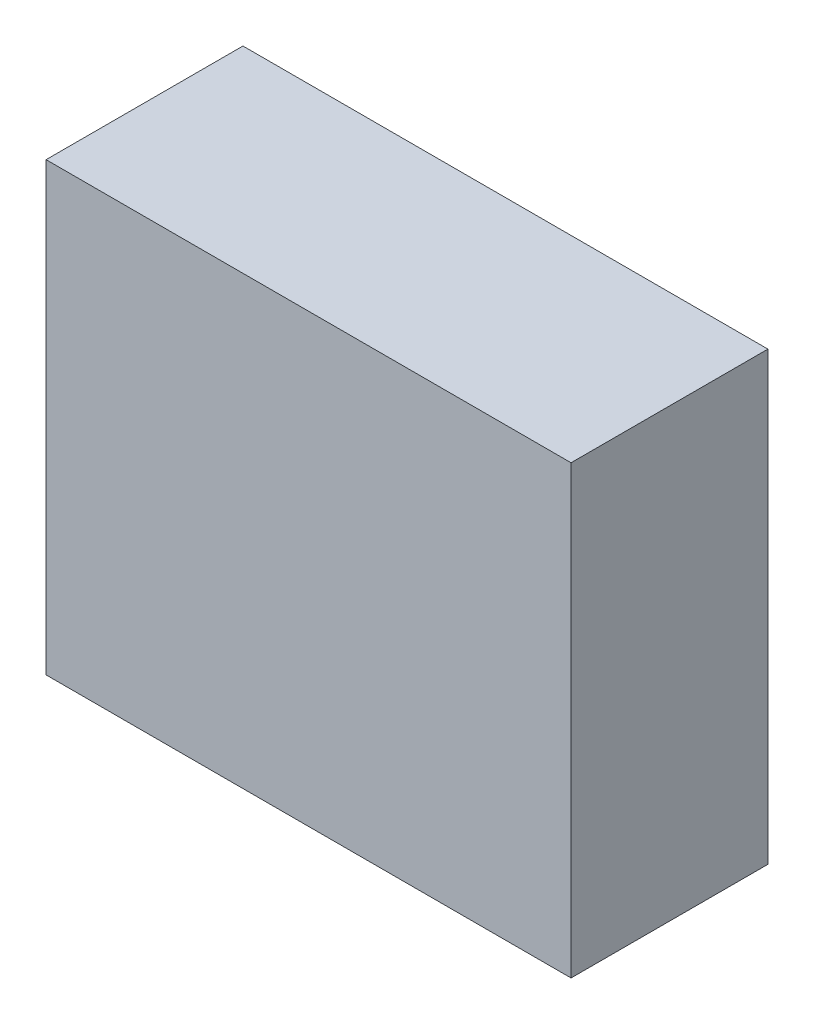
ISO-10303-21;
HEADER;
FILE_DESCRIPTION(('STEP AP214'),'2;1');
FILE_NAME('part.step','',(''),(''),'','','');
FILE_SCHEMA(('AUTOMOTIVE_DESIGN { 1 0 10303 214 1 1 1 1 }'));
ENDSEC;
DATA;
#1=APPLICATION_CONTEXT('core data for automotive mechanical design processes');
#2=APPLICATION_PROTOCOL_DEFINITION('international standard','automotive_design',2000,#1);
#3=PRODUCT_CONTEXT('',#1,'mechanical');
#4=PRODUCT('Part','Part','',(#3));
#5=PRODUCT_RELATED_PRODUCT_CATEGORY('part','',(#4));
#6=PRODUCT_DEFINITION_FORMATION('','',#4);
#7=PRODUCT_DEFINITION_CONTEXT('part definition',#1,'design');
#8=PRODUCT_DEFINITION('design','',#6,#7);
#9=PRODUCT_DEFINITION_SHAPE('','',#8);
#10=(LENGTH_UNIT() NAMED_UNIT(*) SI_UNIT(.MILLI.,.METRE.));
#11=(NAMED_UNIT(*) PLANE_ANGLE_UNIT() SI_UNIT($,.RADIAN.));
#12=(NAMED_UNIT(*) SI_UNIT($,.STERADIAN.) SOLID_ANGLE_UNIT());
#13=UNCERTAINTY_MEASURE_WITH_UNIT(LENGTH_MEASURE(1.E-05),#10,'distance_accuracy_value','');
#14=(GEOMETRIC_REPRESENTATION_CONTEXT(3) GLOBAL_UNCERTAINTY_ASSIGNED_CONTEXT((#13)) GLOBAL_UNIT_ASSIGNED_CONTEXT((#10,
#11,#12)) REPRESENTATION_CONTEXT('',''));
#15=CARTESIAN_POINT('',(0.,0.,0.));
#16=DIRECTION('',(0.,0.,1.));
#17=DIRECTION('',(1.,0.,0.));
#18=AXIS2_PLACEMENT_3D('',#15,#16,#17);
#19=CARTESIAN_POINT('',(-1.00000054,-0.85000084,0.75000104));
#20=DIRECTION('',(0.,0.,-1.));
#21=DIRECTION('',(-1.,0.,0.));
#22=AXIS2_PLACEMENT_3D('',#19,#20,#21);
#23=PLANE('',#22);
#24=DIRECTION('',(0.,1.,0.));
#25=VECTOR('',#24,1.);
#26=CARTESIAN_POINT('',(1.00000054,-0.85000084,0.75000104));
#27=LINE('',#26,#25);
#28=CARTESIAN_POINT('',(1.00000054,-0.85000084,0.75000104));
#29=VERTEX_POINT('',#28);
#30=CARTESIAN_POINT('',(1.00000054,0.85000084,0.75000104));
#31=VERTEX_POINT('',#30);
#32=EDGE_CURVE('E55',#29,#31,#27,.T.);
#33=ORIENTED_EDGE('',*,*,#32,.T.);
#34=DIRECTION('',(1.,0.,0.));
#35=VECTOR('',#34,1.);
#36=CARTESIAN_POINT('',(1.00000054,0.85000084,0.75000104));
#37=LINE('',#36,#35);
#38=CARTESIAN_POINT('',(-1.00000054,0.85000084,0.75000104));
#39=VERTEX_POINT('',#38);
#40=EDGE_CURVE('E57',#31,#39,#37,.F.);
#41=ORIENTED_EDGE('',*,*,#40,.T.);
#42=DIRECTION('',(0.,1.,0.));
#43=VECTOR('',#42,1.);
#44=CARTESIAN_POINT('',(-1.00000054,0.85000084,0.75000104));
#45=LINE('',#44,#43);
#46=CARTESIAN_POINT('',(-1.00000054,-0.85000084,0.75000104));
#47=VERTEX_POINT('',#46);
#48=EDGE_CURVE('E20',#39,#47,#45,.F.);
#49=ORIENTED_EDGE('',*,*,#48,.T.);
#50=DIRECTION('',(1.,0.,0.));
#51=VECTOR('',#50,1.);
#52=CARTESIAN_POINT('',(-1.00000054,-0.85000084,0.75000104));
#53=LINE('',#52,#51);
#54=EDGE_CURVE('E80',#47,#29,#53,.T.);
#55=ORIENTED_EDGE('',*,*,#54,.T.);
#56=EDGE_LOOP('',(#33,#41,#49,#55));
#57=FACE_BOUND('',#56,.T.);
#58=ADVANCED_FACE('F17',(#57),#23,.F.);
#59=CARTESIAN_POINT('',(-1.00000054,0.85000084,0.));
#60=DIRECTION('',(1.,0.,0.));
#61=DIRECTION('',(0.,0.,-1.));
#62=AXIS2_PLACEMENT_3D('',#59,#60,#61);
#63=PLANE('',#62);
#64=DIRECTION('',(0.,0.,1.));
#65=VECTOR('',#64,1.);
#66=CARTESIAN_POINT('',(-1.00000054,-0.85000084,0.));
#67=LINE('',#66,#65);
#68=CARTESIAN_POINT('',(-1.00000054,-0.85000084,0.));
#69=VERTEX_POINT('',#68);
#70=EDGE_CURVE('E68',#69,#47,#67,.T.);
#71=ORIENTED_EDGE('',*,*,#70,.T.);
#72=ORIENTED_EDGE('',*,*,#48,.F.);
#73=DIRECTION('',(0.,0.,-1.));
#74=VECTOR('',#73,1.);
#75=CARTESIAN_POINT('',(-1.00000054,0.85000084,0.));
#76=LINE('',#75,#74);
#77=CARTESIAN_POINT('',(-1.00000054,0.85000084,0.));
#78=VERTEX_POINT('',#77);
#79=EDGE_CURVE('E63',#39,#78,#76,.T.);
#80=ORIENTED_EDGE('',*,*,#79,.T.);
#81=DIRECTION('',(0.,1.,0.));
#82=VECTOR('',#81,1.);
#83=CARTESIAN_POINT('',(-1.00000054,-0.85000084,0.));
#84=LINE('',#83,#82);
#85=EDGE_CURVE('E83',#69,#78,#84,.T.);
#86=ORIENTED_EDGE('',*,*,#85,.F.);
#87=EDGE_LOOP('',(#71,#72,#80,#86));
#88=FACE_BOUND('',#87,.T.);
#89=ADVANCED_FACE('F65',(#88),#63,.F.);
#90=CARTESIAN_POINT('',(1.00000054,0.85000084,0.));
#91=DIRECTION('',(0.,-1.,0.));
#92=DIRECTION('',(0.,0.,-1.));
#93=AXIS2_PLACEMENT_3D('',#90,#91,#92);
#94=PLANE('',#93);
#95=ORIENTED_EDGE('',*,*,#79,.F.);
#96=ORIENTED_EDGE('',*,*,#40,.F.);
#97=DIRECTION('',(0.,0.,1.));
#98=VECTOR('',#97,1.);
#99=CARTESIAN_POINT('',(1.00000054,0.85000084,0.));
#100=LINE('',#99,#98);
#101=CARTESIAN_POINT('',(1.00000054,0.85000084,0.));
#102=VERTEX_POINT('',#101);
#103=EDGE_CURVE('E75',#31,#102,#100,.F.);
#104=ORIENTED_EDGE('',*,*,#103,.T.);
#105=DIRECTION('',(-1.,0.,0.));
#106=VECTOR('',#105,1.);
#107=CARTESIAN_POINT('',(-1.00000054,0.85000084,0.));
#108=LINE('',#107,#106);
#109=EDGE_CURVE('E72',#78,#102,#108,.F.);
#110=ORIENTED_EDGE('',*,*,#109,.F.);
#111=EDGE_LOOP('',(#95,#96,#104,#110));
#112=FACE_BOUND('',#111,.T.);
#113=ADVANCED_FACE('F70',(#112),#94,.F.);
#114=CARTESIAN_POINT('',(1.00000054,-0.85000084,0.));
#115=DIRECTION('',(-1.,0.,0.));
#116=DIRECTION('',(0.,0.,1.));
#117=AXIS2_PLACEMENT_3D('',#114,#115,#116);
#118=PLANE('',#117);
#119=ORIENTED_EDGE('',*,*,#103,.F.);
#120=ORIENTED_EDGE('',*,*,#32,.F.);
#121=DIRECTION('',(0.,0.,1.));
#122=VECTOR('',#121,1.);
#123=CARTESIAN_POINT('',(1.00000054,-0.85000084,0.));
#124=LINE('',#123,#122);
#125=CARTESIAN_POINT('',(1.00000054,-0.85000084,0.));
#126=VERTEX_POINT('',#125);
#127=EDGE_CURVE('E35',#29,#126,#124,.F.);
#128=ORIENTED_EDGE('',*,*,#127,.T.);
#129=DIRECTION('',(0.,1.,0.));
#130=VECTOR('',#129,1.);
#131=CARTESIAN_POINT('',(1.00000054,-0.85000084,0.));
#132=LINE('',#131,#130);
#133=EDGE_CURVE('E26',#102,#126,#132,.F.);
#134=ORIENTED_EDGE('',*,*,#133,.F.);
#135=EDGE_LOOP('',(#119,#120,#128,#134));
#136=FACE_BOUND('',#135,.T.);
#137=ADVANCED_FACE('F89',(#136),#118,.F.);
#138=CARTESIAN_POINT('',(-1.00000054,-0.85000084,0.));
#139=DIRECTION('',(0.,1.,0.));
#140=DIRECTION('',(0.,0.,1.));
#141=AXIS2_PLACEMENT_3D('',#138,#139,#140);
#142=PLANE('',#141);
#143=ORIENTED_EDGE('',*,*,#127,.F.);
#144=ORIENTED_EDGE('',*,*,#54,.F.);
#145=ORIENTED_EDGE('',*,*,#70,.F.);
#146=DIRECTION('',(-1.,0.,0.));
#147=VECTOR('',#146,1.);
#148=CARTESIAN_POINT('',(-1.00000054,-0.85000084,0.));
#149=LINE('',#148,#147);
#150=EDGE_CURVE('E11',#126,#69,#149,.T.);
#151=ORIENTED_EDGE('',*,*,#150,.F.);
#152=EDGE_LOOP('',(#143,#144,#145,#151));
#153=FACE_BOUND('',#152,.T.);
#154=ADVANCED_FACE('F91',(#153),#142,.F.);
#155=CARTESIAN_POINT('',(-1.00000054,-0.85000084,0.));
#156=DIRECTION('',(0.,0.,-1.));
#157=DIRECTION('',(-1.,0.,0.));
#158=AXIS2_PLACEMENT_3D('',#155,#156,#157);
#159=PLANE('',#158);
#160=ORIENTED_EDGE('',*,*,#133,.T.);
#161=ORIENTED_EDGE('',*,*,#150,.T.);
#162=ORIENTED_EDGE('',*,*,#85,.T.);
#163=ORIENTED_EDGE('',*,*,#109,.T.);
#164=EDGE_LOOP('',(#160,#161,#162,#163));
#165=FACE_BOUND('',#164,.T.);
#166=ADVANCED_FACE('F88',(#165),#159,.T.);
#167=CLOSED_SHELL('',(#58,#89,#113,#137,#154,#166));
#168=MANIFOLD_SOLID_BREP('B1',#167);
#169=ADVANCED_BREP_SHAPE_REPRESENTATION('',(#18,#168),#14);
#170=SHAPE_DEFINITION_REPRESENTATION(#9,#169);
ENDSEC;
END-ISO-10303-21;
